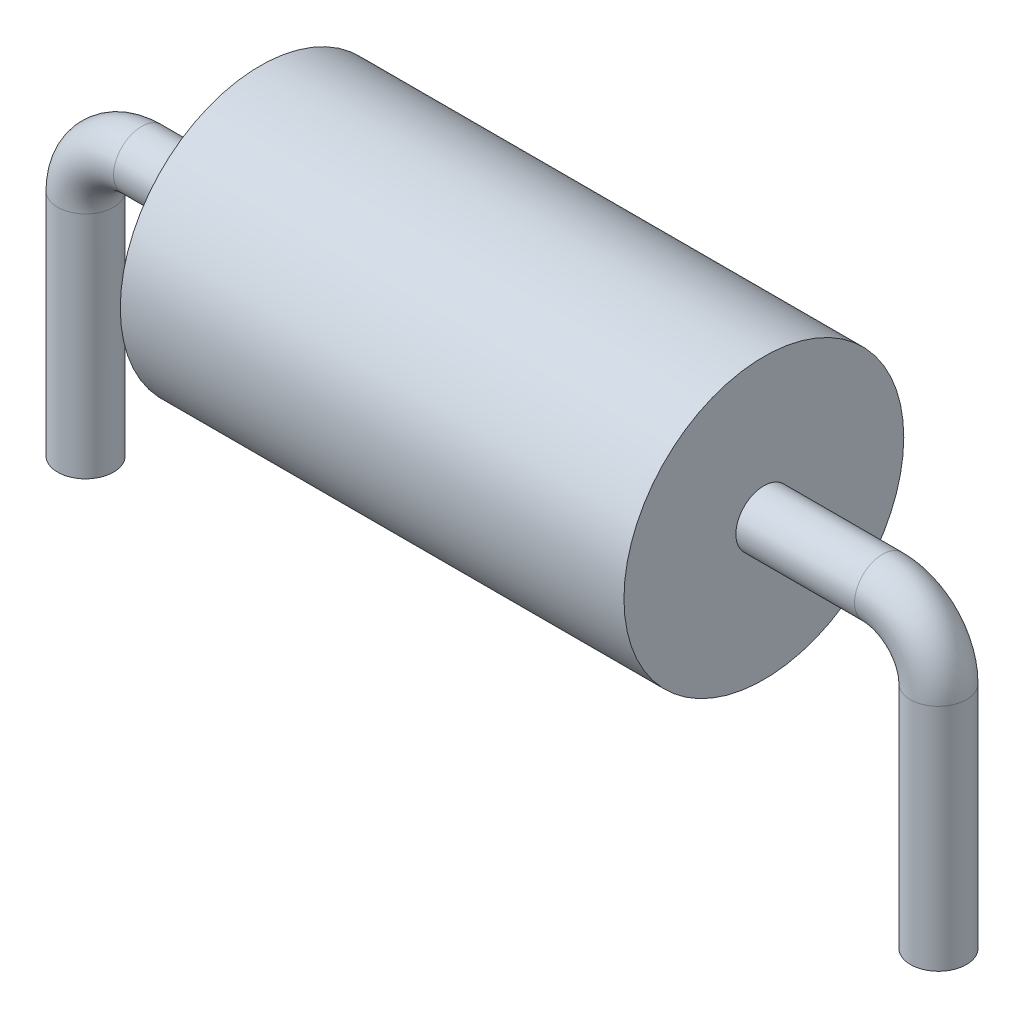
ISO-10303-21;
HEADER;
FILE_DESCRIPTION(('STEP AP214'),'2;1');
FILE_NAME('part.step','',(''),(''),'','','');
FILE_SCHEMA(('AUTOMOTIVE_DESIGN { 1 0 10303 214 1 1 1 1 }'));
ENDSEC;
DATA;
#1=APPLICATION_CONTEXT('core data for automotive mechanical design processes');
#2=APPLICATION_PROTOCOL_DEFINITION('international standard','automotive_design',2000,#1);
#3=PRODUCT_CONTEXT('',#1,'mechanical');
#4=PRODUCT('Part','Part','',(#3));
#5=PRODUCT_RELATED_PRODUCT_CATEGORY('part','',(#4));
#6=PRODUCT_DEFINITION_FORMATION('','',#4);
#7=PRODUCT_DEFINITION_CONTEXT('part definition',#1,'design');
#8=PRODUCT_DEFINITION('design','',#6,#7);
#9=PRODUCT_DEFINITION_SHAPE('','',#8);
#10=(LENGTH_UNIT() NAMED_UNIT(*) SI_UNIT(.MILLI.,.METRE.));
#11=(NAMED_UNIT(*) PLANE_ANGLE_UNIT() SI_UNIT($,.RADIAN.));
#12=(NAMED_UNIT(*) SI_UNIT($,.STERADIAN.) SOLID_ANGLE_UNIT());
#13=UNCERTAINTY_MEASURE_WITH_UNIT(LENGTH_MEASURE(1.E-05),#10,'distance_accuracy_value','');
#14=(GEOMETRIC_REPRESENTATION_CONTEXT(3) GLOBAL_UNCERTAINTY_ASSIGNED_CONTEXT((#13)) GLOBAL_UNIT_ASSIGNED_CONTEXT((#10,
#11,#12)) REPRESENTATION_CONTEXT('',''));
#15=CARTESIAN_POINT('',(0.,0.,0.));
#16=DIRECTION('',(0.,0.,1.));
#17=DIRECTION('',(1.,0.,0.));
#18=AXIS2_PLACEMENT_3D('',#15,#16,#17);
#19=CARTESIAN_POINT('',(-4.5,0.,0.));
#20=DIRECTION('',(1.,0.,0.));
#21=DIRECTION('',(0.,0.,-1.));
#22=AXIS2_PLACEMENT_3D('',#19,#20,#21);
#23=CYLINDRICAL_SURFACE('',#22,2.5);
#24=CARTESIAN_POINT('',(-4.5,0.,0.));
#25=DIRECTION('',(1.,0.,0.));
#26=DIRECTION('',(0.,0.,-1.));
#27=AXIS2_PLACEMENT_3D('',#24,#25,#26);
#28=CIRCLE('',#27,2.5);
#29=CARTESIAN_POINT('',(-4.5,0.,-2.5));
#30=VERTEX_POINT('',#29);
#31=EDGE_CURVE('E43',#30,#30,#28,.T.);
#32=ORIENTED_EDGE('',*,*,#31,.T.);
#33=EDGE_LOOP('',(#32));
#34=FACE_BOUND('',#33,.T.);
#35=CARTESIAN_POINT('',(4.5,0.,0.));
#36=DIRECTION('',(1.,0.,0.));
#37=DIRECTION('',(0.,0.,-1.));
#38=AXIS2_PLACEMENT_3D('',#35,#36,#37);
#39=CIRCLE('',#38,2.5);
#40=CARTESIAN_POINT('',(4.5,0.,-2.5));
#41=VERTEX_POINT('',#40);
#42=EDGE_CURVE('E60',#41,#41,#39,.T.);
#43=ORIENTED_EDGE('',*,*,#42,.F.);
#44=EDGE_LOOP('',(#43));
#45=FACE_BOUND('',#44,.T.);
#46=ADVANCED_FACE('F35',(#34,#45),#23,.T.);
#47=CARTESIAN_POINT('',(-4.5,0.,0.));
#48=DIRECTION('',(1.,0.,0.));
#49=DIRECTION('',(0.,0.,-1.));
#50=AXIS2_PLACEMENT_3D('',#47,#48,#49);
#51=PLANE('',#50);
#52=CARTESIAN_POINT('',(-4.5,0.,0.));
#53=DIRECTION('',(1.,0.,0.));
#54=DIRECTION('',(0.,0.,-1.));
#55=AXIS2_PLACEMENT_3D('',#52,#53,#54);
#56=CIRCLE('',#55,0.5);
#57=CARTESIAN_POINT('',(-4.5,0.,-0.5));
#58=VERTEX_POINT('',#57);
#59=EDGE_CURVE('E11',#58,#58,#56,.F.);
#60=ORIENTED_EDGE('',*,*,#59,.F.);
#61=EDGE_LOOP('',(#60));
#62=FACE_BOUND('',#61,.T.);
#63=ORIENTED_EDGE('',*,*,#31,.F.);
#64=EDGE_LOOP('',(#63));
#65=FACE_BOUND('',#64,.T.);
#66=ADVANCED_FACE('F72',(#62,#65),#51,.F.);
#67=CARTESIAN_POINT('',(4.5,0.,0.));
#68=DIRECTION('',(1.,0.,0.));
#69=DIRECTION('',(0.,0.,-1.));
#70=AXIS2_PLACEMENT_3D('',#67,#68,#69);
#71=PLANE('',#70);
#72=CARTESIAN_POINT('',(4.5,0.,0.));
#73=DIRECTION('',(1.,0.,0.));
#74=DIRECTION('',(0.,0.,-1.));
#75=AXIS2_PLACEMENT_3D('',#72,#73,#74);
#76=CIRCLE('',#75,0.5);
#77=CARTESIAN_POINT('',(4.5,0.,-0.5));
#78=VERTEX_POINT('',#77);
#79=EDGE_CURVE('E38',#78,#78,#76,.F.);
#80=ORIENTED_EDGE('',*,*,#79,.T.);
#81=EDGE_LOOP('',(#80));
#82=FACE_BOUND('',#81,.T.);
#83=ORIENTED_EDGE('',*,*,#42,.T.);
#84=EDGE_LOOP('',(#83));
#85=FACE_BOUND('',#84,.T.);
#86=ADVANCED_FACE('F74',(#82,#85),#71,.T.);
#87=CARTESIAN_POINT('',(7.62,-5.1,0.));
#88=DIRECTION('',(0.,-1.,0.));
#89=DIRECTION('',(0.,0.,-1.));
#90=AXIS2_PLACEMENT_3D('',#87,#88,#89);
#91=PLANE('',#90);
#92=CARTESIAN_POINT('',(7.62,-5.1,0.));
#93=DIRECTION('',(0.,-1.,0.));
#94=DIRECTION('',(0.,0.,-1.));
#95=AXIS2_PLACEMENT_3D('',#92,#93,#94);
#96=CIRCLE('',#95,0.5);
#97=CARTESIAN_POINT('',(7.62,-5.1,-0.5));
#98=VERTEX_POINT('',#97);
#99=EDGE_CURVE('E49',#98,#98,#96,.T.);
#100=ORIENTED_EDGE('',*,*,#99,.T.);
#101=EDGE_LOOP('',(#100));
#102=FACE_BOUND('',#101,.T.);
#103=ADVANCED_FACE('F80',(#102),#91,.T.);
#104=CARTESIAN_POINT('',(7.62,-5.1,0.));
#105=DIRECTION('',(0.,1.,0.));
#106=DIRECTION('',(0.,0.,1.));
#107=AXIS2_PLACEMENT_3D('',#104,#105,#106);
#108=CYLINDRICAL_SURFACE('',#107,0.5);
#109=CARTESIAN_POINT('',(7.62,-1.,0.));
#110=DIRECTION('',(0.,-1.,0.));
#111=DIRECTION('',(0.,0.,-1.));
#112=AXIS2_PLACEMENT_3D('',#109,#110,#111);
#113=CIRCLE('',#112,0.5);
#114=CARTESIAN_POINT('',(8.12,-1.,0.));
#115=VERTEX_POINT('',#114);
#116=EDGE_CURVE('E113',#115,#115,#113,.T.);
#117=ORIENTED_EDGE('',*,*,#116,.T.);
#118=EDGE_LOOP('',(#117));
#119=FACE_BOUND('',#118,.T.);
#120=ORIENTED_EDGE('',*,*,#99,.F.);
#121=EDGE_LOOP('',(#120));
#122=FACE_BOUND('',#121,.T.);
#123=ADVANCED_FACE('F87',(#119,#122),#108,.T.);
#124=CARTESIAN_POINT('',(6.62,-1.,0.));
#125=DIRECTION('',(0.,0.,1.));
#126=DIRECTION('',(1.,0.,0.));
#127=AXIS2_PLACEMENT_3D('',#124,#125,#126);
#128=TOROIDAL_SURFACE('',#127,1.,0.5);
#129=CARTESIAN_POINT('',(6.62,0.,0.));
#130=DIRECTION('',(1.,0.,0.));
#131=DIRECTION('',(0.,0.,-1.));
#132=AXIS2_PLACEMENT_3D('',#129,#130,#131);
#133=CIRCLE('',#132,0.5);
#134=CARTESIAN_POINT('',(6.62,0.5,0.));
#135=VERTEX_POINT('',#134);
#136=EDGE_CURVE('E115',#135,#135,#133,.T.);
#137=CARTESIAN_POINT('',(6.62,-1.,0.));
#138=DIRECTION('',(0.,0.,1.));
#139=DIRECTION('',(1.,0.,0.));
#140=AXIS2_PLACEMENT_3D('',#137,#138,#139);
#141=CIRCLE('',#140,1.5);
#142=EDGE_CURVE('',#115,#135,#141,.T.);
#143=ORIENTED_EDGE('',*,*,#116,.F.);
#144=ORIENTED_EDGE('',*,*,#136,.T.);
#145=ORIENTED_EDGE('',*,*,#142,.T.);
#146=ORIENTED_EDGE('',*,*,#142,.F.);
#147=EDGE_LOOP('',(#143,#145,#144,#146));
#148=FACE_BOUND('',#147,.T.);
#149=ADVANCED_FACE('F102',(#148),#128,.T.);
#150=CARTESIAN_POINT('',(6.62,0.,0.));
#151=DIRECTION('',(-1.,0.,0.));
#152=DIRECTION('',(0.,0.,1.));
#153=AXIS2_PLACEMENT_3D('',#150,#151,#152);
#154=CYLINDRICAL_SURFACE('',#153,0.5);
#155=ORIENTED_EDGE('',*,*,#79,.F.);
#156=EDGE_LOOP('',(#155));
#157=FACE_BOUND('',#156,.T.);
#158=ORIENTED_EDGE('',*,*,#136,.F.);
#159=EDGE_LOOP('',(#158));
#160=FACE_BOUND('',#159,.T.);
#161=ADVANCED_FACE('F99',(#157,#160),#154,.T.);
#162=CARTESIAN_POINT('',(-6.62,0.,0.));
#163=DIRECTION('',(1.,0.,0.));
#164=DIRECTION('',(0.,0.,-1.));
#165=AXIS2_PLACEMENT_3D('',#162,#163,#164);
#166=CIRCLE('',#165,0.5);
#167=CARTESIAN_POINT('',(-6.62,0.5,0.));
#168=VERTEX_POINT('',#167);
#169=EDGE_CURVE('E62',#168,#168,#166,.T.);
#170=ORIENTED_EDGE('',*,*,#169,.T.);
#171=EDGE_LOOP('',(#170));
#172=FACE_BOUND('',#171,.T.);
#173=ORIENTED_EDGE('',*,*,#59,.T.);
#174=EDGE_LOOP('',(#173));
#175=FACE_BOUND('',#174,.T.);
#176=ADVANCED_FACE('F93',(#172,#175),#154,.T.);
#177=CARTESIAN_POINT('',(-7.62,-5.1,0.));
#178=DIRECTION('',(0.,1.,0.));
#179=DIRECTION('',(0.,0.,-1.));
#180=AXIS2_PLACEMENT_3D('',#177,#178,#179);
#181=PLANE('',#180);
#182=CARTESIAN_POINT('',(-7.62,-5.1,0.));
#183=DIRECTION('',(0.,1.,0.));
#184=DIRECTION('',(0.,0.,-1.));
#185=AXIS2_PLACEMENT_3D('',#182,#183,#184);
#186=CIRCLE('',#185,0.5);
#187=CARTESIAN_POINT('',(-7.62,-5.1,-0.5));
#188=VERTEX_POINT('',#187);
#189=EDGE_CURVE('E53',#188,#188,#186,.T.);
#190=ORIENTED_EDGE('',*,*,#189,.F.);
#191=EDGE_LOOP('',(#190));
#192=FACE_BOUND('',#191,.T.);
#193=ADVANCED_FACE('F89',(#192),#181,.F.);
#194=CARTESIAN_POINT('',(-6.62,-1.,0.));
#195=DIRECTION('',(0.,0.,1.));
#196=DIRECTION('',(1.,0.,0.));
#197=AXIS2_PLACEMENT_3D('',#194,#195,#196);
#198=TOROIDAL_SURFACE('',#197,1.,0.5);
#199=CARTESIAN_POINT('',(-7.62,-1.,0.));
#200=DIRECTION('',(0.,1.,0.));
#201=DIRECTION('',(0.,0.,-1.));
#202=AXIS2_PLACEMENT_3D('',#199,#200,#201);
#203=CIRCLE('',#202,0.5);
#204=CARTESIAN_POINT('',(-8.12,-1.,0.));
#205=VERTEX_POINT('',#204);
#206=EDGE_CURVE('E57',#205,#205,#203,.T.);
#207=CARTESIAN_POINT('',(-6.62,-1.,0.));
#208=DIRECTION('',(0.,0.,1.));
#209=DIRECTION('',(1.,0.,0.));
#210=AXIS2_PLACEMENT_3D('',#207,#208,#209);
#211=CIRCLE('',#210,1.5);
#212=EDGE_CURVE('',#168,#205,#211,.T.);
#213=ORIENTED_EDGE('',*,*,#169,.F.);
#214=ORIENTED_EDGE('',*,*,#206,.T.);
#215=ORIENTED_EDGE('',*,*,#212,.T.);
#216=ORIENTED_EDGE('',*,*,#212,.F.);
#217=EDGE_LOOP('',(#213,#215,#214,#216));
#218=FACE_BOUND('',#217,.T.);
#219=ADVANCED_FACE('F92',(#218),#198,.T.);
#220=CARTESIAN_POINT('',(-7.62,-1.,0.));
#221=DIRECTION('',(0.,-1.,0.));
#222=DIRECTION('',(0.,0.,-1.));
#223=AXIS2_PLACEMENT_3D('',#220,#221,#222);
#224=CYLINDRICAL_SURFACE('',#223,0.5);
#225=ORIENTED_EDGE('',*,*,#189,.T.);
#226=EDGE_LOOP('',(#225));
#227=FACE_BOUND('',#226,.T.);
#228=ORIENTED_EDGE('',*,*,#206,.F.);
#229=EDGE_LOOP('',(#228));
#230=FACE_BOUND('',#229,.T.);
#231=ADVANCED_FACE('F54',(#227,#230),#224,.T.);
#232=CLOSED_SHELL('',(#46,#66,#86,#103,#123,#149,#161,#176,#193,#219,#231));
#233=MANIFOLD_SOLID_BREP('B2',#232);
#234=ADVANCED_BREP_SHAPE_REPRESENTATION('',(#18,#233),#14);
#235=SHAPE_DEFINITION_REPRESENTATION(#9,#234);
ENDSEC;
END-ISO-10303-21;
